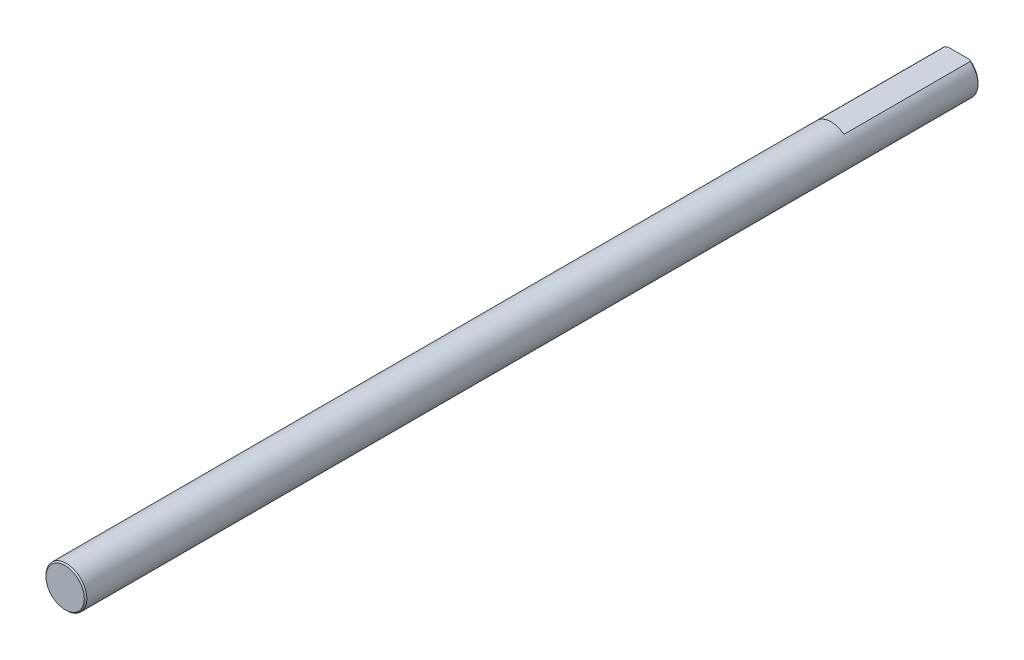
ISO-10303-21;
HEADER;
FILE_DESCRIPTION(('STEP AP214'),'2;1');
FILE_NAME('part.step','',(''),(''),'','','');
FILE_SCHEMA(('AUTOMOTIVE_DESIGN { 1 0 10303 214 1 1 1 1 }'));
ENDSEC;
DATA;
#1=APPLICATION_CONTEXT('core data for automotive mechanical design processes');
#2=APPLICATION_PROTOCOL_DEFINITION('international standard','automotive_design',2000,#1);
#3=PRODUCT_CONTEXT('',#1,'mechanical');
#4=PRODUCT('Part','Part','',(#3));
#5=PRODUCT_RELATED_PRODUCT_CATEGORY('part','',(#4));
#6=PRODUCT_DEFINITION_FORMATION('','',#4);
#7=PRODUCT_DEFINITION_CONTEXT('part definition',#1,'design');
#8=PRODUCT_DEFINITION('design','',#6,#7);
#9=PRODUCT_DEFINITION_SHAPE('','',#8);
#10=(LENGTH_UNIT() NAMED_UNIT(*) SI_UNIT(.MILLI.,.METRE.));
#11=(NAMED_UNIT(*) PLANE_ANGLE_UNIT() SI_UNIT($,.RADIAN.));
#12=(NAMED_UNIT(*) SI_UNIT($,.STERADIAN.) SOLID_ANGLE_UNIT());
#13=UNCERTAINTY_MEASURE_WITH_UNIT(LENGTH_MEASURE(1.E-05),#10,'distance_accuracy_value','');
#14=(GEOMETRIC_REPRESENTATION_CONTEXT(3) GLOBAL_UNCERTAINTY_ASSIGNED_CONTEXT((#13)) GLOBAL_UNIT_ASSIGNED_CONTEXT((#10,
#11,#12)) REPRESENTATION_CONTEXT('',''));
#15=CARTESIAN_POINT('',(0.,0.,0.));
#16=DIRECTION('',(0.,0.,1.));
#17=DIRECTION('',(1.,0.,0.));
#18=AXIS2_PLACEMENT_3D('',#15,#16,#17);
#19=CARTESIAN_POINT('',(0.,0.,70.));
#20=DIRECTION('',(0.,0.,-1.));
#21=DIRECTION('',(-1.,0.,0.));
#22=AXIS2_PLACEMENT_3D('',#19,#20,#21);
#23=CYLINDRICAL_SURFACE('',#22,1.6);
#24=CARTESIAN_POINT('',(0.,0.,69.9));
#25=DIRECTION('',(0.,0.,1.));
#26=DIRECTION('',(1.,0.,0.));
#27=AXIS2_PLACEMENT_3D('',#24,#25,#26);
#28=CIRCLE('',#27,1.6);
#29=CARTESIAN_POINT('',(1.6,0.,69.9));
#30=VERTEX_POINT('',#29);
#31=EDGE_CURVE('E83',#30,#30,#28,.F.);
#32=ORIENTED_EDGE('',*,*,#31,.T.);
#33=EDGE_LOOP('',(#32));
#34=FACE_BOUND('',#33,.T.);
#35=DIRECTION('',(0.,0.,-1.));
#36=VECTOR('',#35,1.);
#37=CARTESIAN_POINT('',(-0.998749217771909,1.25,70.));
#38=LINE('',#37,#36);
#39=CARTESIAN_POINT('',(-0.998749217771909,1.25,10.));
#40=VERTEX_POINT('',#39);
#41=CARTESIAN_POINT('',(-0.998749217771909,1.25,0.099999999999989));
#42=VERTEX_POINT('',#41);
#43=EDGE_CURVE('E65',#40,#42,#38,.T.);
#44=ORIENTED_EDGE('',*,*,#43,.T.);
#45=CARTESIAN_POINT('',(0.,0.,0.099999999999989));
#46=DIRECTION('',(0.,0.,1.));
#47=DIRECTION('',(1.,0.,0.));
#48=AXIS2_PLACEMENT_3D('',#45,#46,#47);
#49=CIRCLE('',#48,1.6);
#50=CARTESIAN_POINT('',(0.998749217771909,1.25,0.099999999999989));
#51=VERTEX_POINT('',#50);
#52=EDGE_CURVE('E86',#42,#51,#49,.T.);
#53=ORIENTED_EDGE('',*,*,#52,.T.);
#54=DIRECTION('',(0.,0.,-1.));
#55=VECTOR('',#54,1.);
#56=CARTESIAN_POINT('',(0.998749217771909,1.25,70.));
#57=LINE('',#56,#55);
#58=CARTESIAN_POINT('',(0.998749217771909,1.25,10.));
#59=VERTEX_POINT('',#58);
#60=EDGE_CURVE('E76',#51,#59,#57,.F.);
#61=ORIENTED_EDGE('',*,*,#60,.T.);
#62=CARTESIAN_POINT('',(0.,0.,10.));
#63=DIRECTION('',(0.,0.,1.));
#64=DIRECTION('',(1.,0.,0.));
#65=AXIS2_PLACEMENT_3D('',#62,#63,#64);
#66=CIRCLE('',#65,1.6);
#67=EDGE_CURVE('E81',#59,#40,#66,.T.);
#68=ORIENTED_EDGE('',*,*,#67,.T.);
#69=EDGE_LOOP('',(#44,#53,#61,#68));
#70=FACE_BOUND('',#69,.T.);
#71=ADVANCED_FACE('F32',(#34,#70),#23,.T.);
#72=CARTESIAN_POINT('',(0.,0.,70.));
#73=DIRECTION('',(0.,0.,1.));
#74=DIRECTION('',(1.,0.,0.));
#75=AXIS2_PLACEMENT_3D('',#72,#73,#74);
#76=PLANE('',#75);
#77=CARTESIAN_POINT('',(0.,0.,70.));
#78=DIRECTION('',(0.,0.,1.));
#79=DIRECTION('',(1.,0.,0.));
#80=AXIS2_PLACEMENT_3D('',#77,#78,#79);
#81=CIRCLE('',#80,1.5);
#82=CARTESIAN_POINT('',(1.5,0.,70.));
#83=VERTEX_POINT('',#82);
#84=EDGE_CURVE('E11',#83,#83,#81,.T.);
#85=ORIENTED_EDGE('',*,*,#84,.T.);
#86=EDGE_LOOP('',(#85));
#87=FACE_BOUND('',#86,.T.);
#88=ADVANCED_FACE('F111',(#87),#76,.T.);
#89=CARTESIAN_POINT('',(0.,0.,0.));
#90=DIRECTION('',(0.,0.,1.));
#91=DIRECTION('',(1.,0.,0.));
#92=AXIS2_PLACEMENT_3D('',#89,#90,#91);
#93=PLANE('',#92);
#94=DIRECTION('',(1.,0.,0.));
#95=VECTOR('',#94,1.);
#96=CARTESIAN_POINT('',(0.,1.25,0.));
#97=LINE('',#96,#95);
#98=CARTESIAN_POINT('',(-0.829156197588852,1.25,0.));
#99=VERTEX_POINT('',#98);
#100=CARTESIAN_POINT('',(0.829156197588852,1.25,0.));
#101=VERTEX_POINT('',#100);
#102=EDGE_CURVE('E75',#99,#101,#97,.T.);
#103=ORIENTED_EDGE('',*,*,#102,.T.);
#104=CARTESIAN_POINT('',(0.,0.,0.));
#105=DIRECTION('',(0.,0.,1.));
#106=DIRECTION('',(1.,0.,0.));
#107=AXIS2_PLACEMENT_3D('',#104,#105,#106);
#108=CIRCLE('',#107,1.5);
#109=EDGE_CURVE('E40',#101,#99,#108,.F.);
#110=ORIENTED_EDGE('',*,*,#109,.T.);
#111=EDGE_LOOP('',(#103,#110));
#112=FACE_BOUND('',#111,.T.);
#113=ADVANCED_FACE('F110',(#112),#93,.F.);
#114=CARTESIAN_POINT('',(-1.6,1.6,10.));
#115=DIRECTION('',(0.,0.,1.));
#116=DIRECTION('',(1.,0.,0.));
#117=AXIS2_PLACEMENT_3D('',#114,#115,#116);
#118=PLANE('',#117);
#119=DIRECTION('',(1.,0.,0.));
#120=VECTOR('',#119,1.);
#121=CARTESIAN_POINT('',(-1.6,1.25,10.));
#122=LINE('',#121,#120);
#123=EDGE_CURVE('E68',#40,#59,#122,.T.);
#124=ORIENTED_EDGE('',*,*,#123,.F.);
#125=ORIENTED_EDGE('',*,*,#67,.F.);
#126=EDGE_LOOP('',(#124,#125));
#127=FACE_BOUND('',#126,.T.);
#128=ADVANCED_FACE('F80',(#127),#118,.F.);
#129=CARTESIAN_POINT('',(-1.6,1.25,10.));
#130=DIRECTION('',(0.,-1.,0.));
#131=DIRECTION('',(0.,0.,-1.));
#132=AXIS2_PLACEMENT_3D('',#129,#130,#131);
#133=PLANE('',#132);
#134=ORIENTED_EDGE('',*,*,#60,.F.);
#135=CARTESIAN_POINT('',(0.998749217771909,1.25,0.099999999999989));
#136=CARTESIAN_POINT('',(0.970925281349004,1.25,0.08258483249539));
#137=CARTESIAN_POINT('',(0.942880642716664,1.25,0.0655439604692451));
#138=CARTESIAN_POINT('',(0.886349640987012,1.25,0.0322106186596026));
#139=CARTESIAN_POINT('',(0.857863272891686,1.25,0.0159181573523861));
#140=CARTESIAN_POINT('',(0.829156197588912,1.25,0.));
#141=B_SPLINE_CURVE_WITH_KNOTS('',3,(#135,#136,#137,#138,#139,#140),.UNSPECIFIED.,.F.,.F.,(4,2,
4),(0.,0.0984481471581338,0.196897409036454),.UNSPECIFIED.);
#142=EDGE_CURVE('E47',#51,#101,#141,.T.);
#143=ORIENTED_EDGE('',*,*,#142,.T.);
#144=ORIENTED_EDGE('',*,*,#102,.F.);
#145=CARTESIAN_POINT('',(-0.829156197588852,1.25,0.));
#146=CARTESIAN_POINT('',(-0.857863272891651,1.25,0.0159181573524399));
#147=CARTESIAN_POINT('',(-0.886349640986997,1.25,0.0322106186596244));
#148=CARTESIAN_POINT('',(-0.942880642716676,1.25,0.065543960469221));
#149=CARTESIAN_POINT('',(-0.970925281349024,1.25,0.082584832495352));
#150=CARTESIAN_POINT('',(-0.998749217771933,1.25,0.0999999999999464));
#151=B_SPLINE_CURVE_WITH_KNOTS('',3,(#145,#146,#147,#148,#149,#150),.UNSPECIFIED.,.F.,.F.,(4,2,
4),(0.,0.0984492618783229,0.196897409036457),.UNSPECIFIED.);
#152=EDGE_CURVE('E70',#99,#42,#151,.T.);
#153=ORIENTED_EDGE('',*,*,#152,.T.);
#154=ORIENTED_EDGE('',*,*,#43,.F.);
#155=ORIENTED_EDGE('',*,*,#123,.T.);
#156=EDGE_LOOP('',(#134,#143,#144,#153,#154,#155));
#157=FACE_BOUND('',#156,.T.);
#158=ADVANCED_FACE('F67',(#157),#133,.F.);
#159=CARTESIAN_POINT('',(0.,0.,0.099999999999989));
#160=DIRECTION('',(0.,0.,1.));
#161=DIRECTION('',(1.,0.,0.));
#162=AXIS2_PLACEMENT_3D('',#159,#160,#161);
#163=CONICAL_SURFACE('',#162,1.6,0.785398163397497);
#164=ORIENTED_EDGE('',*,*,#152,.F.);
#165=ORIENTED_EDGE('',*,*,#109,.F.);
#166=ORIENTED_EDGE('',*,*,#142,.F.);
#167=ORIENTED_EDGE('',*,*,#52,.F.);
#168=EDGE_LOOP('',(#164,#165,#166,#167));
#169=FACE_BOUND('',#168,.T.);
#170=ADVANCED_FACE('F101',(#169),#163,.T.);
#171=CARTESIAN_POINT('',(0.,0.,70.));
#172=DIRECTION('',(0.,0.,-1.));
#173=DIRECTION('',(-1.,0.,0.));
#174=AXIS2_PLACEMENT_3D('',#171,#172,#173);
#175=CONICAL_SURFACE('',#174,1.5,0.785398163397428);
#176=ORIENTED_EDGE('',*,*,#31,.F.);
#177=EDGE_LOOP('',(#176));
#178=FACE_BOUND('',#177,.T.);
#179=ORIENTED_EDGE('',*,*,#84,.F.);
#180=EDGE_LOOP('',(#179));
#181=FACE_BOUND('',#180,.T.);
#182=ADVANCED_FACE('F34',(#178,#181),#175,.T.);
#183=CLOSED_SHELL('',(#71,#88,#113,#128,#158,#170,#182));
#184=MANIFOLD_SOLID_BREP('B2',#183);
#185=ADVANCED_BREP_SHAPE_REPRESENTATION('',(#18,#184),#14);
#186=SHAPE_DEFINITION_REPRESENTATION(#9,#185);
ENDSEC;
END-ISO-10303-21;
